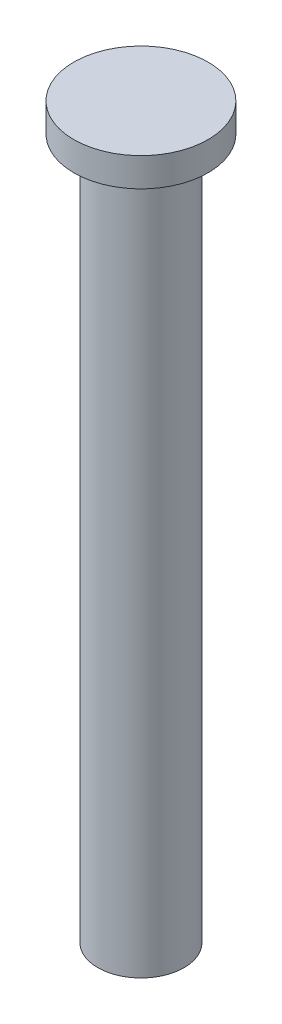
ISO-10303-21;
HEADER;
FILE_DESCRIPTION(('STEP AP214'),'2;1');
FILE_NAME('part.step','',(''),(''),'','','');
FILE_SCHEMA(('AUTOMOTIVE_DESIGN { 1 0 10303 214 1 1 1 1 }'));
ENDSEC;
DATA;
#1=APPLICATION_CONTEXT('core data for automotive mechanical design processes');
#2=APPLICATION_PROTOCOL_DEFINITION('international standard','automotive_design',2000,#1);
#3=PRODUCT_CONTEXT('',#1,'mechanical');
#4=PRODUCT('Part','Part','',(#3));
#5=PRODUCT_RELATED_PRODUCT_CATEGORY('part','',(#4));
#6=PRODUCT_DEFINITION_FORMATION('','',#4);
#7=PRODUCT_DEFINITION_CONTEXT('part definition',#1,'design');
#8=PRODUCT_DEFINITION('design','',#6,#7);
#9=PRODUCT_DEFINITION_SHAPE('','',#8);
#10=(LENGTH_UNIT() NAMED_UNIT(*) SI_UNIT(.MILLI.,.METRE.));
#11=(NAMED_UNIT(*) PLANE_ANGLE_UNIT() SI_UNIT($,.RADIAN.));
#12=(NAMED_UNIT(*) SI_UNIT($,.STERADIAN.) SOLID_ANGLE_UNIT());
#13=UNCERTAINTY_MEASURE_WITH_UNIT(LENGTH_MEASURE(1.E-05),#10,'distance_accuracy_value','');
#14=(GEOMETRIC_REPRESENTATION_CONTEXT(3) GLOBAL_UNCERTAINTY_ASSIGNED_CONTEXT((#13)) GLOBAL_UNIT_ASSIGNED_CONTEXT((#10,
#11,#12)) REPRESENTATION_CONTEXT('',''));
#15=CARTESIAN_POINT('',(0.,0.,0.));
#16=DIRECTION('',(0.,0.,1.));
#17=DIRECTION('',(1.,0.,0.));
#18=AXIS2_PLACEMENT_3D('',#15,#16,#17);
#19=CARTESIAN_POINT('',(0.,314.585289514867,0.));
#20=DIRECTION('',(0.,1.,0.));
#21=DIRECTION('',(0.,0.,1.));
#22=AXIS2_PLACEMENT_3D('',#19,#20,#21);
#23=CYLINDRICAL_SURFACE('',#22,22.5);
#24=CARTESIAN_POINT('',(0.,365.,0.));
#25=DIRECTION('',(0.,1.,0.));
#26=DIRECTION('',(0.,0.,1.));
#27=AXIS2_PLACEMENT_3D('',#24,#25,#26);
#28=CIRCLE('',#27,22.5);
#29=CARTESIAN_POINT('',(0.,365.,22.5));
#30=VERTEX_POINT('',#29);
#31=EDGE_CURVE('E48',#30,#30,#28,.T.);
#32=ORIENTED_EDGE('',*,*,#31,.F.);
#33=EDGE_LOOP('',(#32));
#34=FACE_BOUND('',#33,.T.);
#35=CARTESIAN_POINT('',(0.,0.,0.));
#36=DIRECTION('',(0.,1.,0.));
#37=DIRECTION('',(0.,0.,1.));
#38=AXIS2_PLACEMENT_3D('',#35,#36,#37);
#39=CIRCLE('',#38,22.5);
#40=CARTESIAN_POINT('',(0.,0.,22.5));
#41=VERTEX_POINT('',#40);
#42=EDGE_CURVE('E10',#41,#41,#39,.T.);
#43=ORIENTED_EDGE('',*,*,#42,.T.);
#44=EDGE_LOOP('',(#43));
#45=FACE_BOUND('',#44,.T.);
#46=ADVANCED_FACE('F34',(#34,#45),#23,.T.);
#47=CARTESIAN_POINT('',(22.5,0.,0.));
#48=DIRECTION('',(0.,1.,0.));
#49=DIRECTION('',(0.,0.,1.));
#50=AXIS2_PLACEMENT_3D('',#47,#48,#49);
#51=PLANE('',#50);
#52=ORIENTED_EDGE('',*,*,#42,.F.);
#53=EDGE_LOOP('',(#52));
#54=FACE_BOUND('',#53,.T.);
#55=ADVANCED_FACE('F57',(#54),#51,.F.);
#56=CARTESIAN_POINT('',(0.,380.,0.));
#57=DIRECTION('',(0.,-1.,0.));
#58=DIRECTION('',(0.,0.,-1.));
#59=AXIS2_PLACEMENT_3D('',#56,#57,#58);
#60=PLANE('',#59);
#61=CARTESIAN_POINT('',(0.,380.,0.));
#62=DIRECTION('',(0.,1.,0.));
#63=DIRECTION('',(0.,0.,1.));
#64=AXIS2_PLACEMENT_3D('',#61,#62,#63);
#65=CIRCLE('',#64,35.);
#66=CARTESIAN_POINT('',(0.,380.,35.));
#67=VERTEX_POINT('',#66);
#68=EDGE_CURVE('E40',#67,#67,#65,.T.);
#69=ORIENTED_EDGE('',*,*,#68,.T.);
#70=EDGE_LOOP('',(#69));
#71=FACE_BOUND('',#70,.T.);
#72=ADVANCED_FACE('F61',(#71),#60,.F.);
#73=CARTESIAN_POINT('',(0.,314.585289514867,0.));
#74=DIRECTION('',(0.,1.,0.));
#75=DIRECTION('',(0.,0.,1.));
#76=AXIS2_PLACEMENT_3D('',#73,#74,#75);
#77=CYLINDRICAL_SURFACE('',#76,35.);
#78=ORIENTED_EDGE('',*,*,#68,.F.);
#79=EDGE_LOOP('',(#78));
#80=FACE_BOUND('',#79,.T.);
#81=CARTESIAN_POINT('',(0.,365.,0.));
#82=DIRECTION('',(0.,1.,0.));
#83=DIRECTION('',(0.,0.,1.));
#84=AXIS2_PLACEMENT_3D('',#81,#82,#83);
#85=CIRCLE('',#84,35.);
#86=CARTESIAN_POINT('',(0.,365.,35.));
#87=VERTEX_POINT('',#86);
#88=EDGE_CURVE('E44',#87,#87,#85,.T.);
#89=ORIENTED_EDGE('',*,*,#88,.T.);
#90=EDGE_LOOP('',(#89));
#91=FACE_BOUND('',#90,.T.);
#92=ADVANCED_FACE('F66',(#80,#91),#77,.T.);
#93=CARTESIAN_POINT('',(35.,365.,0.));
#94=DIRECTION('',(0.,1.,0.));
#95=DIRECTION('',(0.,0.,1.));
#96=AXIS2_PLACEMENT_3D('',#93,#94,#95);
#97=PLANE('',#96);
#98=ORIENTED_EDGE('',*,*,#88,.F.);
#99=EDGE_LOOP('',(#98));
#100=FACE_BOUND('',#99,.T.);
#101=ORIENTED_EDGE('',*,*,#31,.T.);
#102=EDGE_LOOP('',(#101));
#103=FACE_BOUND('',#102,.T.);
#104=ADVANCED_FACE('F54',(#100,#103),#97,.F.);
#105=CLOSED_SHELL('',(#46,#55,#72,#92,#104));
#106=MANIFOLD_SOLID_BREP('B2',#105);
#107=ADVANCED_BREP_SHAPE_REPRESENTATION('',(#18,#106),#14);
#108=SHAPE_DEFINITION_REPRESENTATION(#9,#107);
ENDSEC;
END-ISO-10303-21;
